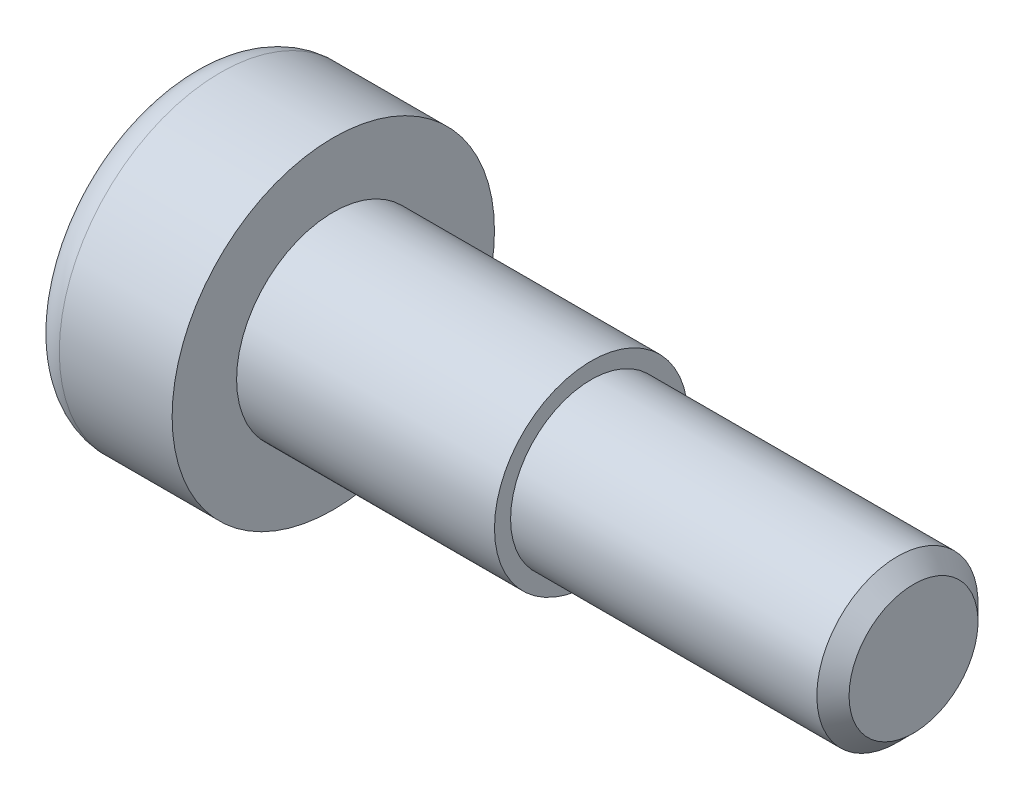
ISO-10303-21;
HEADER;
FILE_DESCRIPTION(('STEP AP214'),'2;1');
FILE_NAME('part.step','',(''),(''),'','','');
FILE_SCHEMA(('AUTOMOTIVE_DESIGN { 1 0 10303 214 1 1 1 1 }'));
ENDSEC;
DATA;
#1=APPLICATION_CONTEXT('core data for automotive mechanical design processes');
#2=APPLICATION_PROTOCOL_DEFINITION('international standard','automotive_design',2000,#1);
#3=PRODUCT_CONTEXT('',#1,'mechanical');
#4=PRODUCT('Part','Part','',(#3));
#5=PRODUCT_RELATED_PRODUCT_CATEGORY('part','',(#4));
#6=PRODUCT_DEFINITION_FORMATION('','',#4);
#7=PRODUCT_DEFINITION_CONTEXT('part definition',#1,'design');
#8=PRODUCT_DEFINITION('design','',#6,#7);
#9=PRODUCT_DEFINITION_SHAPE('','',#8);
#10=(LENGTH_UNIT() NAMED_UNIT(*) SI_UNIT(.MILLI.,.METRE.));
#11=(NAMED_UNIT(*) PLANE_ANGLE_UNIT() SI_UNIT($,.RADIAN.));
#12=(NAMED_UNIT(*) SI_UNIT($,.STERADIAN.) SOLID_ANGLE_UNIT());
#13=UNCERTAINTY_MEASURE_WITH_UNIT(LENGTH_MEASURE(1.E-05),#10,'distance_accuracy_value','');
#14=(GEOMETRIC_REPRESENTATION_CONTEXT(3) GLOBAL_UNCERTAINTY_ASSIGNED_CONTEXT((#13)) GLOBAL_UNIT_ASSIGNED_CONTEXT((#10,
#11,#12)) REPRESENTATION_CONTEXT('',''));
#15=CARTESIAN_POINT('',(0.,0.,0.));
#16=DIRECTION('',(0.,0.,1.));
#17=DIRECTION('',(1.,0.,0.));
#18=AXIS2_PLACEMENT_3D('',#15,#16,#17);
#19=CARTESIAN_POINT('',(0.,0.,0.));
#20=DIRECTION('',(1.,0.,0.));
#21=DIRECTION('',(0.,0.,-1.));
#22=AXIS2_PLACEMENT_3D('',#19,#20,#21);
#23=PLANE('',#22);
#24=CARTESIAN_POINT('',(0.,0.,0.));
#25=DIRECTION('',(1.,0.,0.));
#26=DIRECTION('',(0.,0.,-1.));
#27=AXIS2_PLACEMENT_3D('',#24,#25,#26);
#28=CIRCLE('',#27,4.);
#29=CARTESIAN_POINT('',(0.,0.,-4.));
#30=VERTEX_POINT('',#29);
#31=EDGE_CURVE('E157',#30,#30,#28,.F.);
#32=ORIENTED_EDGE('',*,*,#31,.T.);
#33=EDGE_LOOP('',(#32));
#34=FACE_BOUND('',#33,.T.);
#35=DIRECTION('',(0.,-0.5,-0.866025403784439));
#36=VECTOR('',#35,1.);
#37=CARTESIAN_POINT('',(0.,1.73205080756888,0.));
#38=LINE('',#37,#36);
#39=CARTESIAN_POINT('',(0.,1.73205080756888,0.));
#40=VERTEX_POINT('',#39);
#41=CARTESIAN_POINT('',(0.,0.866025403784439,-1.5));
#42=VERTEX_POINT('',#41);
#43=EDGE_CURVE('E127',#40,#42,#38,.T.);
#44=ORIENTED_EDGE('',*,*,#43,.F.);
#45=DIRECTION('',(0.,0.5,-0.866025403784439));
#46=VECTOR('',#45,1.);
#47=CARTESIAN_POINT('',(0.,0.86602540378444,1.5));
#48=LINE('',#47,#46);
#49=CARTESIAN_POINT('',(0.,0.86602540378444,1.5));
#50=VERTEX_POINT('',#49);
#51=EDGE_CURVE('E53',#50,#40,#48,.T.);
#52=ORIENTED_EDGE('',*,*,#51,.F.);
#53=DIRECTION('',(0.,1.,0.));
#54=VECTOR('',#53,1.);
#55=CARTESIAN_POINT('',(0.,-0.866025403784439,1.5));
#56=LINE('',#55,#54);
#57=CARTESIAN_POINT('',(0.,-0.866025403784439,1.5));
#58=VERTEX_POINT('',#57);
#59=EDGE_CURVE('E136',#58,#50,#56,.T.);
#60=ORIENTED_EDGE('',*,*,#59,.F.);
#61=DIRECTION('',(0.,0.5,0.866025403784439));
#62=VECTOR('',#61,1.);
#63=CARTESIAN_POINT('',(0.,-1.73205080756888,0.));
#64=LINE('',#63,#62);
#65=CARTESIAN_POINT('',(0.,-1.73205080756888,0.));
#66=VERTEX_POINT('',#65);
#67=EDGE_CURVE('E134',#66,#58,#64,.T.);
#68=ORIENTED_EDGE('',*,*,#67,.F.);
#69=DIRECTION('',(0.,-0.5,0.866025403784439));
#70=VECTOR('',#69,1.);
#71=CARTESIAN_POINT('',(0.,-0.866025403784439,-1.5));
#72=LINE('',#71,#70);
#73=CARTESIAN_POINT('',(0.,-0.866025403784439,-1.5));
#74=VERTEX_POINT('',#73);
#75=EDGE_CURVE('E101',#74,#66,#72,.T.);
#76=ORIENTED_EDGE('',*,*,#75,.F.);
#77=DIRECTION('',(0.,-1.,0.));
#78=VECTOR('',#77,1.);
#79=CARTESIAN_POINT('',(0.,0.866025403784439,-1.5));
#80=LINE('',#79,#78);
#81=EDGE_CURVE('E130',#42,#74,#80,.T.);
#82=ORIENTED_EDGE('',*,*,#81,.F.);
#83=EDGE_LOOP('',(#44,#52,#60,#68,#76,#82));
#84=FACE_BOUND('',#83,.T.);
#85=ADVANCED_FACE('F38',(#34,#84),#23,.F.);
#86=CARTESIAN_POINT('',(0.,0.,0.));
#87=DIRECTION('',(-1.,0.,0.));
#88=DIRECTION('',(0.,0.,1.));
#89=AXIS2_PLACEMENT_3D('',#86,#87,#88);
#90=CYLINDRICAL_SURFACE('',#89,5.);
#91=CARTESIAN_POINT('',(1.,0.,0.));
#92=DIRECTION('',(1.,0.,0.));
#93=DIRECTION('',(0.,0.,-1.));
#94=AXIS2_PLACEMENT_3D('',#91,#92,#93);
#95=CIRCLE('',#94,5.);
#96=CARTESIAN_POINT('',(1.,0.,-5.));
#97=VERTEX_POINT('',#96);
#98=EDGE_CURVE('E160',#97,#97,#95,.T.);
#99=ORIENTED_EDGE('',*,*,#98,.T.);
#100=EDGE_LOOP('',(#99));
#101=FACE_BOUND('',#100,.T.);
#102=CARTESIAN_POINT('',(4.5,0.,0.));
#103=DIRECTION('',(-1.,0.,0.));
#104=DIRECTION('',(0.,0.,1.));
#105=AXIS2_PLACEMENT_3D('',#102,#103,#104);
#106=CIRCLE('',#105,5.);
#107=CARTESIAN_POINT('',(4.5,0.,5.));
#108=VERTEX_POINT('',#107);
#109=EDGE_CURVE('E154',#108,#108,#106,.T.);
#110=ORIENTED_EDGE('',*,*,#109,.T.);
#111=EDGE_LOOP('',(#110));
#112=FACE_BOUND('',#111,.T.);
#113=ADVANCED_FACE('F177',(#101,#112),#90,.T.);
#114=CARTESIAN_POINT('',(4.5,5.,0.));
#115=DIRECTION('',(-1.,0.,0.));
#116=DIRECTION('',(0.,0.,1.));
#117=AXIS2_PLACEMENT_3D('',#114,#115,#116);
#118=PLANE('',#117);
#119=ORIENTED_EDGE('',*,*,#109,.F.);
#120=EDGE_LOOP('',(#119));
#121=FACE_BOUND('',#120,.T.);
#122=CARTESIAN_POINT('',(4.5,0.,0.));
#123=DIRECTION('',(-1.,0.,0.));
#124=DIRECTION('',(0.,0.,1.));
#125=AXIS2_PLACEMENT_3D('',#122,#123,#124);
#126=CIRCLE('',#125,3.);
#127=CARTESIAN_POINT('',(4.5,0.,3.));
#128=VERTEX_POINT('',#127);
#129=EDGE_CURVE('E151',#128,#128,#126,.T.);
#130=ORIENTED_EDGE('',*,*,#129,.T.);
#131=EDGE_LOOP('',(#130));
#132=FACE_BOUND('',#131,.T.);
#133=ADVANCED_FACE('F183',(#121,#132),#118,.F.);
#134=CARTESIAN_POINT('',(0.,0.,0.));
#135=DIRECTION('',(-1.,0.,0.));
#136=DIRECTION('',(0.,0.,1.));
#137=AXIS2_PLACEMENT_3D('',#134,#135,#136);
#138=CYLINDRICAL_SURFACE('',#137,3.);
#139=ORIENTED_EDGE('',*,*,#129,.F.);
#140=EDGE_LOOP('',(#139));
#141=FACE_BOUND('',#140,.T.);
#142=CARTESIAN_POINT('',(12.5,0.,0.));
#143=DIRECTION('',(-1.,0.,0.));
#144=DIRECTION('',(0.,0.,1.));
#145=AXIS2_PLACEMENT_3D('',#142,#143,#144);
#146=CIRCLE('',#145,3.);
#147=CARTESIAN_POINT('',(12.5,0.,3.));
#148=VERTEX_POINT('',#147);
#149=EDGE_CURVE('E148',#148,#148,#146,.T.);
#150=ORIENTED_EDGE('',*,*,#149,.T.);
#151=EDGE_LOOP('',(#150));
#152=FACE_BOUND('',#151,.T.);
#153=ADVANCED_FACE('F190',(#141,#152),#138,.T.);
#154=CARTESIAN_POINT('',(12.5,3.,0.));
#155=DIRECTION('',(-1.,0.,0.));
#156=DIRECTION('',(0.,0.,1.));
#157=AXIS2_PLACEMENT_3D('',#154,#155,#156);
#158=PLANE('',#157);
#159=ORIENTED_EDGE('',*,*,#149,.F.);
#160=EDGE_LOOP('',(#159));
#161=FACE_BOUND('',#160,.T.);
#162=CARTESIAN_POINT('',(12.5,0.,0.));
#163=DIRECTION('',(-1.,0.,0.));
#164=DIRECTION('',(0.,0.,1.));
#165=AXIS2_PLACEMENT_3D('',#162,#163,#164);
#166=CIRCLE('',#165,2.5);
#167=CARTESIAN_POINT('',(12.5,0.,2.5));
#168=VERTEX_POINT('',#167);
#169=EDGE_CURVE('E140',#168,#168,#166,.T.);
#170=ORIENTED_EDGE('',*,*,#169,.T.);
#171=EDGE_LOOP('',(#170));
#172=FACE_BOUND('',#171,.T.);
#173=ADVANCED_FACE('F194',(#161,#172),#158,.F.);
#174=CARTESIAN_POINT('',(0.,0.,0.));
#175=DIRECTION('',(-1.,0.,0.));
#176=DIRECTION('',(0.,0.,1.));
#177=AXIS2_PLACEMENT_3D('',#174,#175,#176);
#178=CYLINDRICAL_SURFACE('',#177,2.5);
#179=CARTESIAN_POINT('',(22.,0.,0.));
#180=DIRECTION('',(-1.,0.,0.));
#181=DIRECTION('',(0.,0.,1.));
#182=AXIS2_PLACEMENT_3D('',#179,#180,#181);
#183=CIRCLE('',#182,2.5);
#184=CARTESIAN_POINT('',(22.,0.,2.5));
#185=VERTEX_POINT('',#184);
#186=EDGE_CURVE('E46',#185,#185,#183,.T.);
#187=ORIENTED_EDGE('',*,*,#186,.T.);
#188=EDGE_LOOP('',(#187));
#189=FACE_BOUND('',#188,.T.);
#190=ORIENTED_EDGE('',*,*,#169,.F.);
#191=EDGE_LOOP('',(#190));
#192=FACE_BOUND('',#191,.T.);
#193=ADVANCED_FACE('F165',(#189,#192),#178,.T.);
#194=CARTESIAN_POINT('',(22.5,2.5,0.));
#195=DIRECTION('',(-1.,0.,0.));
#196=DIRECTION('',(0.,0.,1.));
#197=AXIS2_PLACEMENT_3D('',#194,#195,#196);
#198=PLANE('',#197);
#199=CARTESIAN_POINT('',(22.5,0.,0.));
#200=DIRECTION('',(-1.,0.,0.));
#201=DIRECTION('',(0.,0.,1.));
#202=AXIS2_PLACEMENT_3D('',#199,#200,#201);
#203=CIRCLE('',#202,1.99999999999999);
#204=CARTESIAN_POINT('',(22.5,0.,1.99999999999999));
#205=VERTEX_POINT('',#204);
#206=EDGE_CURVE('E11',#205,#205,#203,.F.);
#207=ORIENTED_EDGE('',*,*,#206,.T.);
#208=EDGE_LOOP('',(#207));
#209=FACE_BOUND('',#208,.T.);
#210=ADVANCED_FACE('F201',(#209),#198,.F.);
#211=CARTESIAN_POINT('',(3.,0.86602540378444,1.5));
#212=DIRECTION('',(0.,0.866025403784439,0.5));
#213=DIRECTION('',(0.,-0.5,0.866025403784439));
#214=AXIS2_PLACEMENT_3D('',#211,#212,#213);
#215=PLANE('',#214);
#216=ORIENTED_EDGE('',*,*,#51,.T.);
#217=DIRECTION('',(-1.,0.,0.));
#218=VECTOR('',#217,1.);
#219=CARTESIAN_POINT('',(3.,1.73205080756888,0.));
#220=LINE('',#219,#218);
#221=CARTESIAN_POINT('',(3.,1.73205080756888,0.));
#222=VERTEX_POINT('',#221);
#223=EDGE_CURVE('E83',#222,#40,#220,.T.);
#224=ORIENTED_EDGE('',*,*,#223,.F.);
#225=DIRECTION('',(0.,0.5,-0.866025403784439));
#226=VECTOR('',#225,1.);
#227=CARTESIAN_POINT('',(3.,0.86602540378444,1.5));
#228=LINE('',#227,#226);
#229=CARTESIAN_POINT('',(3.,0.86602540378444,1.5));
#230=VERTEX_POINT('',#229);
#231=EDGE_CURVE('E138',#230,#222,#228,.T.);
#232=ORIENTED_EDGE('',*,*,#231,.F.);
#233=DIRECTION('',(-1.,0.,0.));
#234=VECTOR('',#233,1.);
#235=CARTESIAN_POINT('',(3.,0.86602540378444,1.5));
#236=LINE('',#235,#234);
#237=EDGE_CURVE('E61',#230,#50,#236,.T.);
#238=ORIENTED_EDGE('',*,*,#237,.T.);
#239=EDGE_LOOP('',(#216,#224,#232,#238));
#240=FACE_BOUND('',#239,.T.);
#241=ADVANCED_FACE('F204',(#240),#215,.F.);
#242=CARTESIAN_POINT('',(3.,-0.866025403784439,1.5));
#243=DIRECTION('',(0.,0.,1.));
#244=DIRECTION('',(1.,0.,0.));
#245=AXIS2_PLACEMENT_3D('',#242,#243,#244);
#246=PLANE('',#245);
#247=ORIENTED_EDGE('',*,*,#59,.T.);
#248=ORIENTED_EDGE('',*,*,#237,.F.);
#249=DIRECTION('',(0.,1.,0.));
#250=VECTOR('',#249,1.);
#251=CARTESIAN_POINT('',(3.,-0.866025403784439,1.5));
#252=LINE('',#251,#250);
#253=CARTESIAN_POINT('',(3.,-0.866025403784439,1.5));
#254=VERTEX_POINT('',#253);
#255=EDGE_CURVE('E113',#254,#230,#252,.T.);
#256=ORIENTED_EDGE('',*,*,#255,.F.);
#257=DIRECTION('',(-1.,0.,0.));
#258=VECTOR('',#257,1.);
#259=CARTESIAN_POINT('',(3.,-0.866025403784439,1.5));
#260=LINE('',#259,#258);
#261=EDGE_CURVE('E105',#254,#58,#260,.T.);
#262=ORIENTED_EDGE('',*,*,#261,.T.);
#263=EDGE_LOOP('',(#247,#248,#256,#262));
#264=FACE_BOUND('',#263,.T.);
#265=ADVANCED_FACE('F208',(#264),#246,.F.);
#266=CARTESIAN_POINT('',(3.,-1.73205080756888,0.));
#267=DIRECTION('',(0.,-0.866025403784439,0.5));
#268=DIRECTION('',(0.,-0.5,-0.866025403784439));
#269=AXIS2_PLACEMENT_3D('',#266,#267,#268);
#270=PLANE('',#269);
#271=ORIENTED_EDGE('',*,*,#67,.T.);
#272=ORIENTED_EDGE('',*,*,#261,.F.);
#273=DIRECTION('',(0.,0.5,0.866025403784439));
#274=VECTOR('',#273,1.);
#275=CARTESIAN_POINT('',(3.,-1.73205080756888,0.));
#276=LINE('',#275,#274);
#277=CARTESIAN_POINT('',(3.,-1.73205080756888,0.));
#278=VERTEX_POINT('',#277);
#279=EDGE_CURVE('E109',#278,#254,#276,.T.);
#280=ORIENTED_EDGE('',*,*,#279,.F.);
#281=DIRECTION('',(-1.,0.,0.));
#282=VECTOR('',#281,1.);
#283=CARTESIAN_POINT('',(3.,-1.73205080756888,0.));
#284=LINE('',#283,#282);
#285=EDGE_CURVE('E94',#278,#66,#284,.T.);
#286=ORIENTED_EDGE('',*,*,#285,.T.);
#287=EDGE_LOOP('',(#271,#272,#280,#286));
#288=FACE_BOUND('',#287,.T.);
#289=ADVANCED_FACE('F110',(#288),#270,.F.);
#290=CARTESIAN_POINT('',(3.,-0.866025403784439,-1.5));
#291=DIRECTION('',(0.,-0.866025403784438,-0.5));
#292=DIRECTION('',(0.,0.5,-0.866025403784439));
#293=AXIS2_PLACEMENT_3D('',#290,#291,#292);
#294=PLANE('',#293);
#295=ORIENTED_EDGE('',*,*,#75,.T.);
#296=ORIENTED_EDGE('',*,*,#285,.F.);
#297=DIRECTION('',(0.,-0.5,0.866025403784439));
#298=VECTOR('',#297,1.);
#299=CARTESIAN_POINT('',(3.,-0.866025403784439,-1.5));
#300=LINE('',#299,#298);
#301=CARTESIAN_POINT('',(3.,-0.866025403784439,-1.5));
#302=VERTEX_POINT('',#301);
#303=EDGE_CURVE('E98',#302,#278,#300,.T.);
#304=ORIENTED_EDGE('',*,*,#303,.F.);
#305=DIRECTION('',(-1.,0.,0.));
#306=VECTOR('',#305,1.);
#307=CARTESIAN_POINT('',(3.,-0.866025403784439,-1.5));
#308=LINE('',#307,#306);
#309=EDGE_CURVE('E106',#302,#74,#308,.T.);
#310=ORIENTED_EDGE('',*,*,#309,.T.);
#311=EDGE_LOOP('',(#295,#296,#304,#310));
#312=FACE_BOUND('',#311,.T.);
#313=ADVANCED_FACE('F96',(#312),#294,.F.);
#314=CARTESIAN_POINT('',(3.,0.866025403784439,-1.5));
#315=DIRECTION('',(0.,0.,-1.));
#316=DIRECTION('',(-1.,0.,0.));
#317=AXIS2_PLACEMENT_3D('',#314,#315,#316);
#318=PLANE('',#317);
#319=ORIENTED_EDGE('',*,*,#81,.T.);
#320=ORIENTED_EDGE('',*,*,#309,.F.);
#321=DIRECTION('',(0.,-1.,0.));
#322=VECTOR('',#321,1.);
#323=CARTESIAN_POINT('',(3.,0.866025403784439,-1.5));
#324=LINE('',#323,#322);
#325=CARTESIAN_POINT('',(3.,0.866025403784439,-1.5));
#326=VERTEX_POINT('',#325);
#327=EDGE_CURVE('E119',#326,#302,#324,.T.);
#328=ORIENTED_EDGE('',*,*,#327,.F.);
#329=DIRECTION('',(-1.,0.,0.));
#330=VECTOR('',#329,1.);
#331=CARTESIAN_POINT('',(3.,0.866025403784439,-1.5));
#332=LINE('',#331,#330);
#333=EDGE_CURVE('E143',#326,#42,#332,.T.);
#334=ORIENTED_EDGE('',*,*,#333,.T.);
#335=EDGE_LOOP('',(#319,#320,#328,#334));
#336=FACE_BOUND('',#335,.T.);
#337=ADVANCED_FACE('F212',(#336),#318,.F.);
#338=CARTESIAN_POINT('',(3.,1.73205080756888,0.));
#339=DIRECTION('',(0.,0.866025403784439,-0.5));
#340=DIRECTION('',(0.,0.5,0.866025403784439));
#341=AXIS2_PLACEMENT_3D('',#338,#339,#340);
#342=PLANE('',#341);
#343=ORIENTED_EDGE('',*,*,#43,.T.);
#344=ORIENTED_EDGE('',*,*,#333,.F.);
#345=DIRECTION('',(0.,-0.5,-0.866025403784439));
#346=VECTOR('',#345,1.);
#347=CARTESIAN_POINT('',(3.,1.73205080756888,0.));
#348=LINE('',#347,#346);
#349=EDGE_CURVE('E121',#222,#326,#348,.T.);
#350=ORIENTED_EDGE('',*,*,#349,.F.);
#351=ORIENTED_EDGE('',*,*,#223,.T.);
#352=EDGE_LOOP('',(#343,#344,#350,#351));
#353=FACE_BOUND('',#352,.T.);
#354=ADVANCED_FACE('F209',(#353),#342,.F.);
#355=CARTESIAN_POINT('',(3.,0.,0.));
#356=DIRECTION('',(-1.,0.,0.));
#357=DIRECTION('',(0.,0.,1.));
#358=AXIS2_PLACEMENT_3D('',#355,#356,#357);
#359=PLANE('',#358);
#360=ORIENTED_EDGE('',*,*,#231,.T.);
#361=ORIENTED_EDGE('',*,*,#349,.T.);
#362=ORIENTED_EDGE('',*,*,#327,.T.);
#363=ORIENTED_EDGE('',*,*,#303,.T.);
#364=ORIENTED_EDGE('',*,*,#279,.T.);
#365=ORIENTED_EDGE('',*,*,#255,.T.);
#366=EDGE_LOOP('',(#360,#361,#362,#363,#364,#365));
#367=FACE_BOUND('',#366,.T.);
#368=ADVANCED_FACE('F116',(#367),#359,.T.);
#369=CARTESIAN_POINT('',(1.,0.,0.));
#370=DIRECTION('',(1.,0.,0.));
#371=DIRECTION('',(0.,0.,-1.));
#372=AXIS2_PLACEMENT_3D('',#369,#370,#371);
#373=TOROIDAL_SURFACE('',#372,4.,1.);
#374=ORIENTED_EDGE('',*,*,#98,.F.);
#375=EDGE_LOOP('',(#374));
#376=FACE_BOUND('',#375,.T.);
#377=ORIENTED_EDGE('',*,*,#31,.F.);
#378=EDGE_LOOP('',(#377));
#379=FACE_BOUND('',#378,.T.);
#380=ADVANCED_FACE('F169',(#376,#379),#373,.T.);
#381=CARTESIAN_POINT('',(22.,0.,0.));
#382=DIRECTION('',(-1.,0.,0.));
#383=DIRECTION('',(0.,0.,1.));
#384=AXIS2_PLACEMENT_3D('',#381,#382,#383);
#385=CONICAL_SURFACE('',#384,2.5,0.785398163397453);
#386=ORIENTED_EDGE('',*,*,#206,.F.);
#387=EDGE_LOOP('',(#386));
#388=FACE_BOUND('',#387,.T.);
#389=ORIENTED_EDGE('',*,*,#186,.F.);
#390=EDGE_LOOP('',(#389));
#391=FACE_BOUND('',#390,.T.);
#392=ADVANCED_FACE('F40',(#388,#391),#385,.T.);
#393=CLOSED_SHELL('',(#85,#113,#133,#153,#173,#193,#210,#241,#265,#289,#313,#337,#354,#368,#380,#392));
#394=MANIFOLD_SOLID_BREP('B2',#393);
#395=ADVANCED_BREP_SHAPE_REPRESENTATION('',(#18,#394),#14);
#396=SHAPE_DEFINITION_REPRESENTATION(#9,#395);
ENDSEC;
END-ISO-10303-21;
